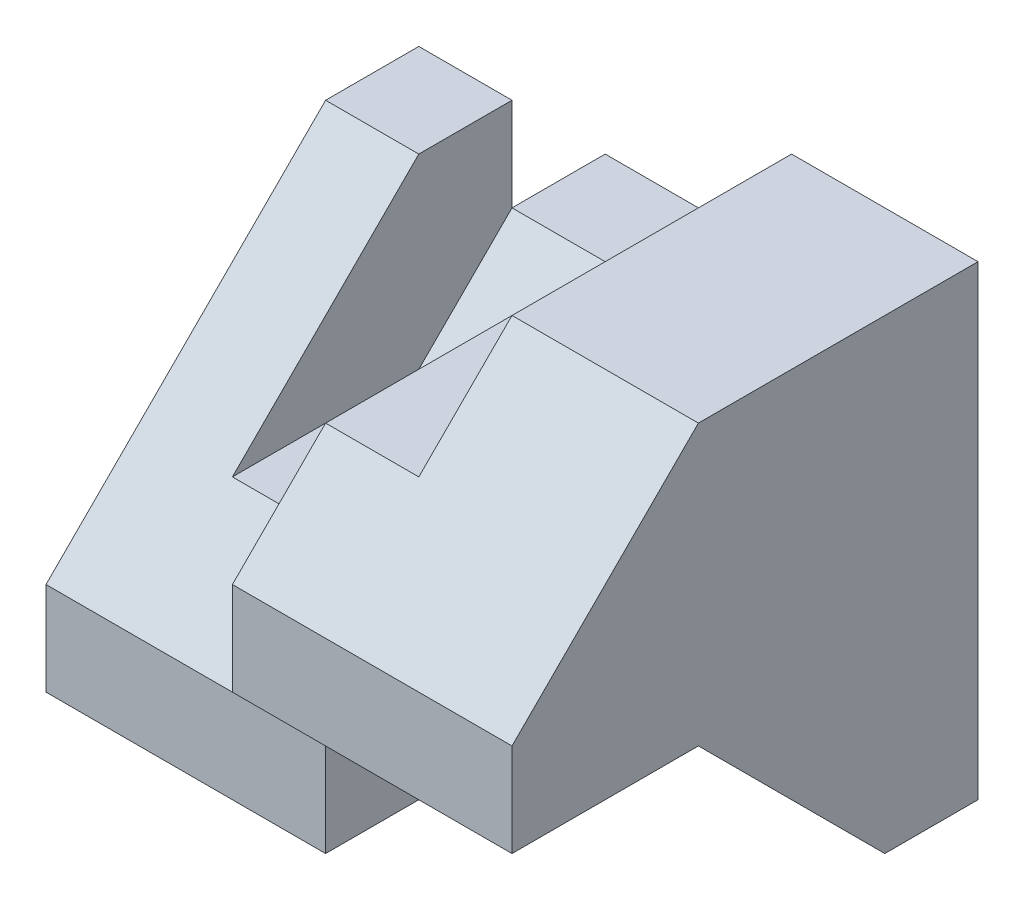
ISO-10303-21;
HEADER;
FILE_DESCRIPTION(('STEP AP214'),'2;1');
FILE_NAME('part.step','',(''),(''),'','','');
FILE_SCHEMA(('AUTOMOTIVE_DESIGN { 1 0 10303 214 1 1 1 1 }'));
ENDSEC;
DATA;
#1=APPLICATION_CONTEXT('core data for automotive mechanical design processes');
#2=APPLICATION_PROTOCOL_DEFINITION('international standard','automotive_design',2000,#1);
#3=PRODUCT_CONTEXT('',#1,'mechanical');
#4=PRODUCT('Part','Part','',(#3));
#5=PRODUCT_RELATED_PRODUCT_CATEGORY('part','',(#4));
#6=PRODUCT_DEFINITION_FORMATION('','',#4);
#7=PRODUCT_DEFINITION_CONTEXT('part definition',#1,'design');
#8=PRODUCT_DEFINITION('design','',#6,#7);
#9=PRODUCT_DEFINITION_SHAPE('','',#8);
#10=(LENGTH_UNIT() NAMED_UNIT(*) SI_UNIT(.MILLI.,.METRE.));
#11=(NAMED_UNIT(*) PLANE_ANGLE_UNIT() SI_UNIT($,.RADIAN.));
#12=(NAMED_UNIT(*) SI_UNIT($,.STERADIAN.) SOLID_ANGLE_UNIT());
#13=UNCERTAINTY_MEASURE_WITH_UNIT(LENGTH_MEASURE(1.E-05),#10,'distance_accuracy_value','');
#14=(GEOMETRIC_REPRESENTATION_CONTEXT(3) GLOBAL_UNCERTAINTY_ASSIGNED_CONTEXT((#13)) GLOBAL_UNIT_ASSIGNED_CONTEXT((#10,
#11,#12)) REPRESENTATION_CONTEXT('',''));
#15=CARTESIAN_POINT('',(0.,0.,0.));
#16=DIRECTION('',(0.,0.,1.));
#17=DIRECTION('',(1.,0.,0.));
#18=AXIS2_PLACEMENT_3D('',#15,#16,#17);
#19=CARTESIAN_POINT('',(0.,0.,50.));
#20=DIRECTION('',(0.,1.,0.));
#21=DIRECTION('',(0.,0.,1.));
#22=AXIS2_PLACEMENT_3D('',#19,#20,#21);
#23=PLANE('',#22);
#24=DIRECTION('',(1.,0.,0.));
#25=VECTOR('',#24,1.);
#26=CARTESIAN_POINT('',(30.,0.,10.));
#27=LINE('',#26,#25);
#28=CARTESIAN_POINT('',(30.,0.,10.));
#29=VERTEX_POINT('',#28);
#30=CARTESIAN_POINT('',(60.,0.,10.));
#31=VERTEX_POINT('',#30);
#32=EDGE_CURVE('E195',#29,#31,#27,.T.);
#33=ORIENTED_EDGE('',*,*,#32,.F.);
#34=DIRECTION('',(0.,0.,-1.));
#35=VECTOR('',#34,1.);
#36=CARTESIAN_POINT('',(30.,0.,0.));
#37=LINE('',#36,#35);
#38=CARTESIAN_POINT('',(30.,0.,40.));
#39=VERTEX_POINT('',#38);
#40=EDGE_CURVE('E192',#39,#29,#37,.T.);
#41=ORIENTED_EDGE('',*,*,#40,.F.);
#42=DIRECTION('',(-1.,0.,0.));
#43=VECTOR('',#42,1.);
#44=CARTESIAN_POINT('',(0.,0.,40.));
#45=LINE('',#44,#43);
#46=CARTESIAN_POINT('',(0.,0.,40.));
#47=VERTEX_POINT('',#46);
#48=EDGE_CURVE('E295',#39,#47,#45,.T.);
#49=ORIENTED_EDGE('',*,*,#48,.T.);
#50=DIRECTION('',(0.,0.,-1.));
#51=VECTOR('',#50,1.);
#52=CARTESIAN_POINT('',(0.,0.,50.));
#53=LINE('',#52,#51);
#54=CARTESIAN_POINT('',(0.,0.,0.));
#55=VERTEX_POINT('',#54);
#56=EDGE_CURVE('E293',#47,#55,#53,.T.);
#57=ORIENTED_EDGE('',*,*,#56,.T.);
#58=DIRECTION('',(1.,0.,0.));
#59=VECTOR('',#58,1.);
#60=CARTESIAN_POINT('',(0.,0.,0.));
#61=LINE('',#60,#59);
#62=CARTESIAN_POINT('',(60.,0.,0.));
#63=VERTEX_POINT('',#62);
#64=EDGE_CURVE('E282',#55,#63,#61,.T.);
#65=ORIENTED_EDGE('',*,*,#64,.T.);
#66=DIRECTION('',(0.,0.,-1.));
#67=VECTOR('',#66,1.);
#68=CARTESIAN_POINT('',(60.,0.,50.));
#69=LINE('',#68,#67);
#70=EDGE_CURVE('E291',#31,#63,#69,.T.);
#71=ORIENTED_EDGE('',*,*,#70,.F.);
#72=EDGE_LOOP('',(#33,#41,#49,#57,#65,#71));
#73=FACE_BOUND('',#72,.T.);
#74=ADVANCED_FACE('F33',(#73),#23,.F.);
#75=CARTESIAN_POINT('',(60.,0.,50.));
#76=DIRECTION('',(-1.,0.,0.));
#77=DIRECTION('',(0.,0.,1.));
#78=AXIS2_PLACEMENT_3D('',#75,#76,#77);
#79=PLANE('',#78);
#80=DIRECTION('',(0.,-0.707106781186548,-0.707106781186548));
#81=VECTOR('',#80,1.);
#82=CARTESIAN_POINT('',(60.,-5.,5.));
#83=LINE('',#82,#81);
#84=CARTESIAN_POINT('',(60.,20.,30.));
#85=VERTEX_POINT('',#84);
#86=EDGE_CURVE('E188',#85,#31,#83,.T.);
#87=ORIENTED_EDGE('',*,*,#86,.T.);
#88=ORIENTED_EDGE('',*,*,#70,.T.);
#89=DIRECTION('',(0.,1.,0.));
#90=VECTOR('',#89,1.);
#91=CARTESIAN_POINT('',(60.,0.,0.));
#92=LINE('',#91,#90);
#93=CARTESIAN_POINT('',(60.,50.,0.));
#94=VERTEX_POINT('',#93);
#95=EDGE_CURVE('E285',#63,#94,#92,.T.);
#96=ORIENTED_EDGE('',*,*,#95,.T.);
#97=DIRECTION('',(0.,0.,-1.));
#98=VECTOR('',#97,1.);
#99=CARTESIAN_POINT('',(60.,50.,50.));
#100=LINE('',#99,#98);
#101=CARTESIAN_POINT('',(60.,50.,30.));
#102=VERTEX_POINT('',#101);
#103=EDGE_CURVE('E278',#102,#94,#100,.T.);
#104=ORIENTED_EDGE('',*,*,#103,.F.);
#105=DIRECTION('',(0.,0.707106781186547,-0.707106781186548));
#106=VECTOR('',#105,1.);
#107=CARTESIAN_POINT('',(60.,50.,30.));
#108=LINE('',#107,#106);
#109=CARTESIAN_POINT('',(60.,30.,50.));
#110=VERTEX_POINT('',#109);
#111=EDGE_CURVE('E212',#110,#102,#108,.T.);
#112=ORIENTED_EDGE('',*,*,#111,.F.);
#113=DIRECTION('',(0.,1.,0.));
#114=VECTOR('',#113,1.);
#115=CARTESIAN_POINT('',(60.,0.,50.));
#116=LINE('',#115,#114);
#117=CARTESIAN_POINT('',(60.,20.,50.));
#118=VERTEX_POINT('',#117);
#119=EDGE_CURVE('E276',#118,#110,#116,.T.);
#120=ORIENTED_EDGE('',*,*,#119,.F.);
#121=DIRECTION('',(0.,0.,-1.));
#122=VECTOR('',#121,1.);
#123=CARTESIAN_POINT('',(60.,20.,30.));
#124=LINE('',#123,#122);
#125=EDGE_CURVE('E200',#118,#85,#124,.T.);
#126=ORIENTED_EDGE('',*,*,#125,.T.);
#127=EDGE_LOOP('',(#87,#88,#96,#104,#112,#120,#126));
#128=FACE_BOUND('',#127,.T.);
#129=ADVANCED_FACE('F334',(#128),#79,.F.);
#130=CARTESIAN_POINT('',(0.,-10.,40.));
#131=DIRECTION('',(0.,0.,-1.));
#132=DIRECTION('',(-1.,0.,0.));
#133=AXIS2_PLACEMENT_3D('',#130,#131,#132);
#134=PLANE('',#133);
#135=DIRECTION('',(0.,-1.,0.));
#136=VECTOR('',#135,1.);
#137=CARTESIAN_POINT('',(30.,0.,40.));
#138=LINE('',#137,#136);
#139=CARTESIAN_POINT('',(30.,10.,40.));
#140=VERTEX_POINT('',#139);
#141=EDGE_CURVE('E190',#140,#39,#138,.T.);
#142=ORIENTED_EDGE('',*,*,#141,.F.);
#143=DIRECTION('',(-1.,0.,0.));
#144=VECTOR('',#143,1.);
#145=CARTESIAN_POINT('',(0.,10.,40.));
#146=LINE('',#145,#144);
#147=CARTESIAN_POINT('',(0.,10.,40.));
#148=VERTEX_POINT('',#147);
#149=EDGE_CURVE('E231',#140,#148,#146,.T.);
#150=ORIENTED_EDGE('',*,*,#149,.T.);
#151=DIRECTION('',(0.,1.,0.));
#152=VECTOR('',#151,1.);
#153=CARTESIAN_POINT('',(0.,-10.,40.));
#154=LINE('',#153,#152);
#155=EDGE_CURVE('E233',#47,#148,#154,.T.);
#156=ORIENTED_EDGE('',*,*,#155,.F.);
#157=ORIENTED_EDGE('',*,*,#48,.F.);
#158=EDGE_LOOP('',(#142,#150,#156,#157));
#159=FACE_BOUND('',#158,.T.);
#160=ADVANCED_FACE('F321',(#159),#134,.F.);
#161=CARTESIAN_POINT('',(0.,10.,40.));
#162=DIRECTION('',(0.,-0.707106781186548,-0.707106781186548));
#163=DIRECTION('',(0.,0.707106781186547,-0.707106781186548));
#164=AXIS2_PLACEMENT_3D('',#161,#162,#163);
#165=PLANE('',#164);
#166=DIRECTION('',(0.,-0.707106781186548,0.707106781186548));
#167=VECTOR('',#166,1.);
#168=CARTESIAN_POINT('',(30.,25.,25.));
#169=LINE('',#168,#167);
#170=CARTESIAN_POINT('',(30.,20.,30.));
#171=VERTEX_POINT('',#170);
#172=EDGE_CURVE('E187',#171,#140,#169,.T.);
#173=ORIENTED_EDGE('',*,*,#172,.F.);
#174=DIRECTION('',(0.,0.707106781186547,-0.707106781186548));
#175=VECTOR('',#174,1.);
#176=CARTESIAN_POINT('',(30.,10.,40.));
#177=LINE('',#176,#175);
#178=CARTESIAN_POINT('',(30.,40.,10.));
#179=VERTEX_POINT('',#178);
#180=EDGE_CURVE('E208',#171,#179,#177,.T.);
#181=ORIENTED_EDGE('',*,*,#180,.T.);
#182=DIRECTION('',(-1.,0.,0.));
#183=VECTOR('',#182,1.);
#184=CARTESIAN_POINT('',(20.,40.,10.));
#185=LINE('',#184,#183);
#186=CARTESIAN_POINT('',(20.,40.,10.));
#187=VERTEX_POINT('',#186);
#188=EDGE_CURVE('E237',#179,#187,#185,.T.);
#189=ORIENTED_EDGE('',*,*,#188,.T.);
#190=DIRECTION('',(0.,-0.707106781186547,0.707106781186548));
#191=VECTOR('',#190,1.);
#192=CARTESIAN_POINT('',(20.,10.,40.));
#193=LINE('',#192,#191);
#194=CARTESIAN_POINT('',(20.,20.,30.));
#195=VERTEX_POINT('',#194);
#196=EDGE_CURVE('E11',#187,#195,#193,.T.);
#197=ORIENTED_EDGE('',*,*,#196,.T.);
#198=DIRECTION('',(-1.,0.,0.));
#199=VECTOR('',#198,1.);
#200=CARTESIAN_POINT('',(0.,20.,30.));
#201=LINE('',#200,#199);
#202=CARTESIAN_POINT('',(10.,20.,30.));
#203=VERTEX_POINT('',#202);
#204=EDGE_CURVE('E297',#195,#203,#201,.T.);
#205=ORIENTED_EDGE('',*,*,#204,.T.);
#206=DIRECTION('',(0.,0.707106781186547,-0.707106781186548));
#207=VECTOR('',#206,1.);
#208=CARTESIAN_POINT('',(10.,10.,40.));
#209=LINE('',#208,#207);
#210=CARTESIAN_POINT('',(10.,40.,10.));
#211=VERTEX_POINT('',#210);
#212=EDGE_CURVE('E41',#203,#211,#209,.T.);
#213=ORIENTED_EDGE('',*,*,#212,.T.);
#214=DIRECTION('',(-1.,0.,0.));
#215=VECTOR('',#214,1.);
#216=CARTESIAN_POINT('',(0.,40.,10.));
#217=LINE('',#216,#215);
#218=CARTESIAN_POINT('',(0.,40.,10.));
#219=VERTEX_POINT('',#218);
#220=EDGE_CURVE('E239',#211,#219,#217,.T.);
#221=ORIENTED_EDGE('',*,*,#220,.T.);
#222=DIRECTION('',(0.,0.707106781186547,-0.707106781186548));
#223=VECTOR('',#222,1.);
#224=CARTESIAN_POINT('',(0.,10.,40.));
#225=LINE('',#224,#223);
#226=EDGE_CURVE('E210',#148,#219,#225,.T.);
#227=ORIENTED_EDGE('',*,*,#226,.F.);
#228=ORIENTED_EDGE('',*,*,#149,.F.);
#229=EDGE_LOOP('',(#173,#181,#189,#197,#205,#213,#221,#227,#228));
#230=FACE_BOUND('',#229,.T.);
#231=ADVANCED_FACE('F302',(#230),#165,.F.);
#232=CARTESIAN_POINT('',(30.,40.,10.));
#233=DIRECTION('',(1.,0.,0.));
#234=DIRECTION('',(0.,1.,0.));
#235=AXIS2_PLACEMENT_3D('',#232,#233,#234);
#236=PLANE('',#235);
#237=ORIENTED_EDGE('',*,*,#180,.F.);
#238=DIRECTION('',(0.,0.,-1.));
#239=VECTOR('',#238,1.);
#240=CARTESIAN_POINT('',(30.,20.,30.));
#241=LINE('',#240,#239);
#242=CARTESIAN_POINT('',(30.,20.,50.));
#243=VERTEX_POINT('',#242);
#244=EDGE_CURVE('E199',#243,#171,#241,.T.);
#245=ORIENTED_EDGE('',*,*,#244,.F.);
#246=DIRECTION('',(0.,1.,0.));
#247=VECTOR('',#246,1.);
#248=CARTESIAN_POINT('',(30.,40.,50.));
#249=LINE('',#248,#247);
#250=CARTESIAN_POINT('',(30.,30.,50.));
#251=VERTEX_POINT('',#250);
#252=EDGE_CURVE('E236',#243,#251,#249,.T.);
#253=ORIENTED_EDGE('',*,*,#252,.T.);
#254=DIRECTION('',(0.,0.707106781186547,-0.707106781186548));
#255=VECTOR('',#254,1.);
#256=CARTESIAN_POINT('',(30.,50.,30.));
#257=LINE('',#256,#255);
#258=CARTESIAN_POINT('',(30.,40.,40.));
#259=VERTEX_POINT('',#258);
#260=EDGE_CURVE('E215',#251,#259,#257,.T.);
#261=ORIENTED_EDGE('',*,*,#260,.T.);
#262=DIRECTION('',(0.,0.,1.));
#263=VECTOR('',#262,1.);
#264=CARTESIAN_POINT('',(30.,40.,10.));
#265=LINE('',#264,#263);
#266=EDGE_CURVE('E242',#179,#259,#265,.T.);
#267=ORIENTED_EDGE('',*,*,#266,.F.);
#268=EDGE_LOOP('',(#237,#245,#253,#261,#267));
#269=FACE_BOUND('',#268,.T.);
#270=ADVANCED_FACE('F348',(#269),#236,.F.);
#271=CARTESIAN_POINT('',(40.,50.,0.));
#272=DIRECTION('',(1.,0.,0.));
#273=DIRECTION('',(0.,0.,-1.));
#274=AXIS2_PLACEMENT_3D('',#271,#272,#273);
#275=PLANE('',#274);
#276=DIRECTION('',(0.,1.,0.));
#277=VECTOR('',#276,1.);
#278=CARTESIAN_POINT('',(40.,50.,0.));
#279=LINE('',#278,#277);
#280=CARTESIAN_POINT('',(40.,40.,0.));
#281=VERTEX_POINT('',#280);
#282=CARTESIAN_POINT('',(40.,50.,0.));
#283=VERTEX_POINT('',#282);
#284=EDGE_CURVE('E264',#281,#283,#279,.T.);
#285=ORIENTED_EDGE('',*,*,#284,.F.);
#286=DIRECTION('',(0.,0.,1.));
#287=VECTOR('',#286,1.);
#288=CARTESIAN_POINT('',(40.,40.,0.));
#289=LINE('',#288,#287);
#290=CARTESIAN_POINT('',(40.,40.,40.));
#291=VERTEX_POINT('',#290);
#292=EDGE_CURVE('E271',#281,#291,#289,.T.);
#293=ORIENTED_EDGE('',*,*,#292,.T.);
#294=DIRECTION('',(0.,0.707106781186547,-0.707106781186548));
#295=VECTOR('',#294,1.);
#296=CARTESIAN_POINT('',(40.,65.,15.));
#297=LINE('',#296,#295);
#298=CARTESIAN_POINT('',(40.,50.,30.));
#299=VERTEX_POINT('',#298);
#300=EDGE_CURVE('E222',#291,#299,#297,.T.);
#301=ORIENTED_EDGE('',*,*,#300,.T.);
#302=DIRECTION('',(0.,0.,1.));
#303=VECTOR('',#302,1.);
#304=CARTESIAN_POINT('',(40.,50.,0.));
#305=LINE('',#304,#303);
#306=EDGE_CURVE('E267',#283,#299,#305,.T.);
#307=ORIENTED_EDGE('',*,*,#306,.F.);
#308=EDGE_LOOP('',(#285,#293,#301,#307));
#309=FACE_BOUND('',#308,.T.);
#310=ADVANCED_FACE('F359',(#309),#275,.F.);
#311=CARTESIAN_POINT('',(10.,20.,0.));
#312=DIRECTION('',(0.,-1.,0.));
#313=DIRECTION('',(0.,0.,-1.));
#314=AXIS2_PLACEMENT_3D('',#311,#312,#313);
#315=PLANE('',#314);
#316=DIRECTION('',(0.,0.,1.));
#317=VECTOR('',#316,1.);
#318=CARTESIAN_POINT('',(10.,20.,0.));
#319=LINE('',#318,#317);
#320=CARTESIAN_POINT('',(10.,20.,0.));
#321=VERTEX_POINT('',#320);
#322=EDGE_CURVE('E56',#321,#203,#319,.T.);
#323=ORIENTED_EDGE('',*,*,#322,.T.);
#324=ORIENTED_EDGE('',*,*,#204,.F.);
#325=DIRECTION('',(0.,0.,1.));
#326=VECTOR('',#325,1.);
#327=CARTESIAN_POINT('',(20.,20.,0.));
#328=LINE('',#327,#326);
#329=CARTESIAN_POINT('',(20.,20.,0.));
#330=VERTEX_POINT('',#329);
#331=EDGE_CURVE('E258',#330,#195,#328,.T.);
#332=ORIENTED_EDGE('',*,*,#331,.F.);
#333=DIRECTION('',(1.,0.,0.));
#334=VECTOR('',#333,1.);
#335=CARTESIAN_POINT('',(10.,20.,0.));
#336=LINE('',#335,#334);
#337=EDGE_CURVE('E249',#321,#330,#336,.T.);
#338=ORIENTED_EDGE('',*,*,#337,.F.);
#339=EDGE_LOOP('',(#323,#324,#332,#338));
#340=FACE_BOUND('',#339,.T.);
#341=ADVANCED_FACE('F366',(#340),#315,.F.);
#342=CARTESIAN_POINT('',(0.,0.,50.));
#343=DIRECTION('',(0.,0.,-1.));
#344=DIRECTION('',(-1.,0.,0.));
#345=AXIS2_PLACEMENT_3D('',#342,#343,#344);
#346=PLANE('',#345);
#347=ORIENTED_EDGE('',*,*,#252,.F.);
#348=DIRECTION('',(-1.,0.,0.));
#349=VECTOR('',#348,1.);
#350=CARTESIAN_POINT('',(60.,20.,50.));
#351=LINE('',#350,#349);
#352=EDGE_CURVE('E203',#118,#243,#351,.T.);
#353=ORIENTED_EDGE('',*,*,#352,.F.);
#354=ORIENTED_EDGE('',*,*,#119,.T.);
#355=DIRECTION('',(-1.,0.,0.));
#356=VECTOR('',#355,1.);
#357=CARTESIAN_POINT('',(60.,30.,50.));
#358=LINE('',#357,#356);
#359=EDGE_CURVE('E228',#110,#251,#358,.T.);
#360=ORIENTED_EDGE('',*,*,#359,.T.);
#361=EDGE_LOOP('',(#347,#353,#354,#360));
#362=FACE_BOUND('',#361,.T.);
#363=ADVANCED_FACE('F343',(#362),#346,.F.);
#364=CARTESIAN_POINT('',(0.,40.,0.));
#365=DIRECTION('',(0.,-1.,0.));
#366=DIRECTION('',(0.,0.,-1.));
#367=AXIS2_PLACEMENT_3D('',#364,#365,#366);
#368=PLANE('',#367);
#369=DIRECTION('',(0.,0.,1.));
#370=VECTOR('',#369,1.);
#371=CARTESIAN_POINT('',(0.,40.,0.));
#372=LINE('',#371,#370);
#373=CARTESIAN_POINT('',(0.,40.,0.));
#374=VERTEX_POINT('',#373);
#375=EDGE_CURVE('E266',#374,#219,#372,.T.);
#376=ORIENTED_EDGE('',*,*,#375,.T.);
#377=ORIENTED_EDGE('',*,*,#220,.F.);
#378=DIRECTION('',(0.,0.,1.));
#379=VECTOR('',#378,1.);
#380=CARTESIAN_POINT('',(10.,40.,0.));
#381=LINE('',#380,#379);
#382=CARTESIAN_POINT('',(10.,40.,0.));
#383=VERTEX_POINT('',#382);
#384=EDGE_CURVE('E254',#383,#211,#381,.T.);
#385=ORIENTED_EDGE('',*,*,#384,.F.);
#386=DIRECTION('',(1.,0.,0.));
#387=VECTOR('',#386,1.);
#388=CARTESIAN_POINT('',(0.,40.,0.));
#389=LINE('',#388,#387);
#390=EDGE_CURVE('E261',#374,#383,#389,.T.);
#391=ORIENTED_EDGE('',*,*,#390,.F.);
#392=EDGE_LOOP('',(#376,#377,#385,#391));
#393=FACE_BOUND('',#392,.T.);
#394=ADVANCED_FACE('F307',(#393),#368,.F.);
#395=CARTESIAN_POINT('',(0.,0.,50.));
#396=DIRECTION('',(1.,0.,0.));
#397=DIRECTION('',(0.,0.,-1.));
#398=AXIS2_PLACEMENT_3D('',#395,#396,#397);
#399=PLANE('',#398);
#400=ORIENTED_EDGE('',*,*,#155,.T.);
#401=ORIENTED_EDGE('',*,*,#226,.T.);
#402=ORIENTED_EDGE('',*,*,#375,.F.);
#403=DIRECTION('',(0.,-1.,0.));
#404=VECTOR('',#403,1.);
#405=CARTESIAN_POINT('',(0.,0.,0.));
#406=LINE('',#405,#404);
#407=EDGE_CURVE('E270',#374,#55,#406,.T.);
#408=ORIENTED_EDGE('',*,*,#407,.T.);
#409=ORIENTED_EDGE('',*,*,#56,.F.);
#410=EDGE_LOOP('',(#400,#401,#402,#408,#409));
#411=FACE_BOUND('',#410,.T.);
#412=ADVANCED_FACE('F35',(#411),#399,.F.);
#413=CARTESIAN_POINT('',(0.,50.,50.));
#414=DIRECTION('',(0.,-1.,0.));
#415=DIRECTION('',(0.,0.,-1.));
#416=AXIS2_PLACEMENT_3D('',#413,#414,#415);
#417=PLANE('',#416);
#418=ORIENTED_EDGE('',*,*,#306,.T.);
#419=DIRECTION('',(1.,0.,0.));
#420=VECTOR('',#419,1.);
#421=CARTESIAN_POINT('',(30.,50.,30.));
#422=LINE('',#421,#420);
#423=EDGE_CURVE('E218',#299,#102,#422,.T.);
#424=ORIENTED_EDGE('',*,*,#423,.T.);
#425=ORIENTED_EDGE('',*,*,#103,.T.);
#426=DIRECTION('',(-1.,0.,0.));
#427=VECTOR('',#426,1.);
#428=CARTESIAN_POINT('',(0.,50.,0.));
#429=LINE('',#428,#427);
#430=EDGE_CURVE('E279',#94,#283,#429,.T.);
#431=ORIENTED_EDGE('',*,*,#430,.T.);
#432=EDGE_LOOP('',(#418,#424,#425,#431));
#433=FACE_BOUND('',#432,.T.);
#434=ADVANCED_FACE('F383',(#433),#417,.F.);
#435=CARTESIAN_POINT('',(0.,0.,0.));
#436=DIRECTION('',(0.,0.,-1.));
#437=DIRECTION('',(-1.,0.,0.));
#438=AXIS2_PLACEMENT_3D('',#435,#436,#437);
#439=PLANE('',#438);
#440=DIRECTION('',(0.,1.,0.));
#441=VECTOR('',#440,1.);
#442=CARTESIAN_POINT('',(30.,39.9999,0.));
#443=LINE('',#442,#441);
#444=CARTESIAN_POINT('',(30.,39.9999,0.));
#445=VERTEX_POINT('',#444);
#446=CARTESIAN_POINT('',(30.,40.,0.));
#447=VERTEX_POINT('',#446);
#448=EDGE_CURVE('E180',#445,#447,#443,.T.);
#449=ORIENTED_EDGE('',*,*,#448,.T.);
#450=EDGE_CURVE('E257',#447,#281,#389,.T.);
#451=ORIENTED_EDGE('',*,*,#450,.T.);
#452=ORIENTED_EDGE('',*,*,#284,.T.);
#453=ORIENTED_EDGE('',*,*,#430,.F.);
#454=ORIENTED_EDGE('',*,*,#95,.F.);
#455=ORIENTED_EDGE('',*,*,#64,.F.);
#456=ORIENTED_EDGE('',*,*,#407,.F.);
#457=ORIENTED_EDGE('',*,*,#390,.T.);
#458=DIRECTION('',(0.,-1.,0.));
#459=VECTOR('',#458,1.);
#460=CARTESIAN_POINT('',(10.,40.,0.));
#461=LINE('',#460,#459);
#462=EDGE_CURVE('E246',#383,#321,#461,.T.);
#463=ORIENTED_EDGE('',*,*,#462,.T.);
#464=ORIENTED_EDGE('',*,*,#337,.T.);
#465=DIRECTION('',(0.,1.,0.));
#466=VECTOR('',#465,1.);
#467=CARTESIAN_POINT('',(20.,40.,0.));
#468=LINE('',#467,#466);
#469=CARTESIAN_POINT('',(20.,39.9999,0.));
#470=VERTEX_POINT('',#469);
#471=EDGE_CURVE('E252',#330,#470,#468,.T.);
#472=ORIENTED_EDGE('',*,*,#471,.T.);
#473=DIRECTION('',(-1.,0.,0.));
#474=VECTOR('',#473,1.);
#475=CARTESIAN_POINT('',(20.,39.9999,0.));
#476=LINE('',#475,#474);
#477=EDGE_CURVE('E48',#445,#470,#476,.T.);
#478=ORIENTED_EDGE('',*,*,#477,.F.);
#479=EDGE_LOOP('',(#449,#451,#452,#453,#454,#455,#456,#457,#463,#464,#472,#478));
#480=FACE_BOUND('',#479,.T.);
#481=ADVANCED_FACE('F312',(#480),#439,.T.);
#482=ORIENTED_EDGE('',*,*,#450,.F.);
#483=DIRECTION('',(0.,0.,-1.));
#484=VECTOR('',#483,1.);
#485=CARTESIAN_POINT('',(30.,40.,10.));
#486=LINE('',#485,#484);
#487=EDGE_CURVE('E175',#179,#447,#486,.T.);
#488=ORIENTED_EDGE('',*,*,#487,.F.);
#489=ORIENTED_EDGE('',*,*,#266,.T.);
#490=DIRECTION('',(1.,0.,0.));
#491=VECTOR('',#490,1.);
#492=CARTESIAN_POINT('',(0.,40.,40.));
#493=LINE('',#492,#491);
#494=EDGE_CURVE('E225',#259,#291,#493,.T.);
#495=ORIENTED_EDGE('',*,*,#494,.T.);
#496=ORIENTED_EDGE('',*,*,#292,.F.);
#497=EDGE_LOOP('',(#482,#488,#489,#495,#496));
#498=FACE_BOUND('',#497,.T.);
#499=ADVANCED_FACE('F355',(#498),#368,.F.);
#500=CARTESIAN_POINT('',(10.,40.,0.));
#501=DIRECTION('',(-1.,0.,0.));
#502=DIRECTION('',(0.,0.,1.));
#503=AXIS2_PLACEMENT_3D('',#500,#501,#502);
#504=PLANE('',#503);
#505=ORIENTED_EDGE('',*,*,#384,.T.);
#506=ORIENTED_EDGE('',*,*,#212,.F.);
#507=ORIENTED_EDGE('',*,*,#322,.F.);
#508=ORIENTED_EDGE('',*,*,#462,.F.);
#509=EDGE_LOOP('',(#505,#506,#507,#508));
#510=FACE_BOUND('',#509,.T.);
#511=ADVANCED_FACE('F309',(#510),#504,.F.);
#512=CARTESIAN_POINT('',(20.,40.,0.));
#513=DIRECTION('',(1.,0.,0.));
#514=DIRECTION('',(0.,0.,-1.));
#515=AXIS2_PLACEMENT_3D('',#512,#513,#514);
#516=PLANE('',#515);
#517=ORIENTED_EDGE('',*,*,#196,.F.);
#518=DIRECTION('',(0.,1.,0.));
#519=VECTOR('',#518,1.);
#520=CARTESIAN_POINT('',(20.,39.9999,10.));
#521=LINE('',#520,#519);
#522=CARTESIAN_POINT('',(20.,39.9999,10.));
#523=VERTEX_POINT('',#522);
#524=EDGE_CURVE('E164',#523,#187,#521,.T.);
#525=ORIENTED_EDGE('',*,*,#524,.F.);
#526=DIRECTION('',(0.,0.,1.));
#527=VECTOR('',#526,1.);
#528=CARTESIAN_POINT('',(20.,39.9999,10.));
#529=LINE('',#528,#527);
#530=EDGE_CURVE('E169',#470,#523,#529,.T.);
#531=ORIENTED_EDGE('',*,*,#530,.F.);
#532=ORIENTED_EDGE('',*,*,#471,.F.);
#533=ORIENTED_EDGE('',*,*,#331,.T.);
#534=EDGE_LOOP('',(#517,#525,#531,#532,#533));
#535=FACE_BOUND('',#534,.T.);
#536=ADVANCED_FACE('F177',(#535),#516,.F.);
#537=CARTESIAN_POINT('',(30.,50.,30.));
#538=DIRECTION('',(0.,-0.707106781186548,-0.707106781186547));
#539=DIRECTION('',(0.,0.707106781186547,-0.707106781186548));
#540=AXIS2_PLACEMENT_3D('',#537,#538,#539);
#541=PLANE('',#540);
#542=ORIENTED_EDGE('',*,*,#260,.F.);
#543=ORIENTED_EDGE('',*,*,#359,.F.);
#544=ORIENTED_EDGE('',*,*,#111,.T.);
#545=ORIENTED_EDGE('',*,*,#423,.F.);
#546=ORIENTED_EDGE('',*,*,#300,.F.);
#547=ORIENTED_EDGE('',*,*,#494,.F.);
#548=EDGE_LOOP('',(#542,#543,#544,#545,#546,#547));
#549=FACE_BOUND('',#548,.T.);
#550=ADVANCED_FACE('F351',(#549),#541,.F.);
#551=CARTESIAN_POINT('',(60.,20.,30.));
#552=DIRECTION('',(0.,1.,0.));
#553=DIRECTION('',(-1.,0.,0.));
#554=AXIS2_PLACEMENT_3D('',#551,#552,#553);
#555=PLANE('',#554);
#556=ORIENTED_EDGE('',*,*,#244,.T.);
#557=DIRECTION('',(-1.,0.,0.));
#558=VECTOR('',#557,1.);
#559=CARTESIAN_POINT('',(60.,20.,30.));
#560=LINE('',#559,#558);
#561=EDGE_CURVE('E206',#85,#171,#560,.T.);
#562=ORIENTED_EDGE('',*,*,#561,.F.);
#563=ORIENTED_EDGE('',*,*,#125,.F.);
#564=ORIENTED_EDGE('',*,*,#352,.T.);
#565=EDGE_LOOP('',(#556,#562,#563,#564));
#566=FACE_BOUND('',#565,.T.);
#567=ADVANCED_FACE('F339',(#566),#555,.F.);
#568=CARTESIAN_POINT('',(30.,-5.,5.));
#569=DIRECTION('',(0.,-0.707106781186547,0.707106781186547));
#570=DIRECTION('',(0.,-0.707106781186548,-0.707106781186548));
#571=AXIS2_PLACEMENT_3D('',#568,#569,#570);
#572=PLANE('',#571);
#573=ORIENTED_EDGE('',*,*,#86,.F.);
#574=ORIENTED_EDGE('',*,*,#561,.T.);
#575=DIRECTION('',(0.,-0.707106781186548,-0.707106781186548));
#576=VECTOR('',#575,1.);
#577=CARTESIAN_POINT('',(30.,-5.,5.));
#578=LINE('',#577,#576);
#579=EDGE_CURVE('E185',#171,#29,#578,.T.);
#580=ORIENTED_EDGE('',*,*,#579,.T.);
#581=ORIENTED_EDGE('',*,*,#32,.T.);
#582=EDGE_LOOP('',(#573,#574,#580,#581));
#583=FACE_BOUND('',#582,.T.);
#584=ADVANCED_FACE('F331',(#583),#572,.T.);
#585=CARTESIAN_POINT('',(30.,0.,0.));
#586=DIRECTION('',(1.,0.,0.));
#587=DIRECTION('',(0.,0.,-1.));
#588=AXIS2_PLACEMENT_3D('',#585,#586,#587);
#589=PLANE('',#588);
#590=ORIENTED_EDGE('',*,*,#579,.F.);
#591=ORIENTED_EDGE('',*,*,#172,.T.);
#592=ORIENTED_EDGE('',*,*,#141,.T.);
#593=ORIENTED_EDGE('',*,*,#40,.T.);
#594=EDGE_LOOP('',(#590,#591,#592,#593));
#595=FACE_BOUND('',#594,.T.);
#596=ADVANCED_FACE('F326',(#595),#589,.T.);
#597=CARTESIAN_POINT('',(30.,39.9999,10.));
#598=DIRECTION('',(1.,0.,0.));
#599=DIRECTION('',(0.,0.,-1.));
#600=AXIS2_PLACEMENT_3D('',#597,#598,#599);
#601=PLANE('',#600);
#602=ORIENTED_EDGE('',*,*,#487,.T.);
#603=ORIENTED_EDGE('',*,*,#448,.F.);
#604=DIRECTION('',(0.,0.,-1.));
#605=VECTOR('',#604,1.);
#606=CARTESIAN_POINT('',(30.,39.9999,10.));
#607=LINE('',#606,#605);
#608=CARTESIAN_POINT('',(30.,39.9999,10.));
#609=VERTEX_POINT('',#608);
#610=EDGE_CURVE('E168',#609,#445,#607,.T.);
#611=ORIENTED_EDGE('',*,*,#610,.F.);
#612=DIRECTION('',(0.,1.,0.));
#613=VECTOR('',#612,1.);
#614=CARTESIAN_POINT('',(30.,39.9999,10.));
#615=LINE('',#614,#613);
#616=EDGE_CURVE('E166',#609,#179,#615,.T.);
#617=ORIENTED_EDGE('',*,*,#616,.T.);
#618=EDGE_LOOP('',(#602,#603,#611,#617));
#619=FACE_BOUND('',#618,.T.);
#620=ADVANCED_FACE('F411',(#619),#601,.F.);
#621=CARTESIAN_POINT('',(20.,39.9999,10.));
#622=DIRECTION('',(0.,0.,1.));
#623=DIRECTION('',(1.,0.,0.));
#624=AXIS2_PLACEMENT_3D('',#621,#622,#623);
#625=PLANE('',#624);
#626=ORIENTED_EDGE('',*,*,#188,.F.);
#627=ORIENTED_EDGE('',*,*,#616,.F.);
#628=DIRECTION('',(1.,0.,0.));
#629=VECTOR('',#628,1.);
#630=CARTESIAN_POINT('',(20.,39.9999,10.));
#631=LINE('',#630,#629);
#632=EDGE_CURVE('E160',#523,#609,#631,.T.);
#633=ORIENTED_EDGE('',*,*,#632,.F.);
#634=ORIENTED_EDGE('',*,*,#524,.T.);
#635=EDGE_LOOP('',(#626,#627,#633,#634));
#636=FACE_BOUND('',#635,.T.);
#637=ADVANCED_FACE('F162',(#636),#625,.F.);
#638=CARTESIAN_POINT('',(0.,39.9999,0.));
#639=DIRECTION('',(0.,-1.,0.));
#640=DIRECTION('',(0.,0.,-1.));
#641=AXIS2_PLACEMENT_3D('',#638,#639,#640);
#642=PLANE('',#641);
#643=ORIENTED_EDGE('',*,*,#530,.T.);
#644=ORIENTED_EDGE('',*,*,#632,.T.);
#645=ORIENTED_EDGE('',*,*,#610,.T.);
#646=ORIENTED_EDGE('',*,*,#477,.T.);
#647=EDGE_LOOP('',(#643,#644,#645,#646));
#648=FACE_BOUND('',#647,.T.);
#649=ADVANCED_FACE('F171',(#648),#642,.F.);
#650=CLOSED_SHELL('',(#74,#129,#160,#231,#270,#310,#341,#363,#394,#412,#434,#481,#499,#511,#536,
#550,#567,#584,#596,#620,#637,#649));
#651=MANIFOLD_SOLID_BREP('B2',#650);
#652=ADVANCED_BREP_SHAPE_REPRESENTATION('',(#18,#651),#14);
#653=SHAPE_DEFINITION_REPRESENTATION(#9,#652);
ENDSEC;
END-ISO-10303-21;
